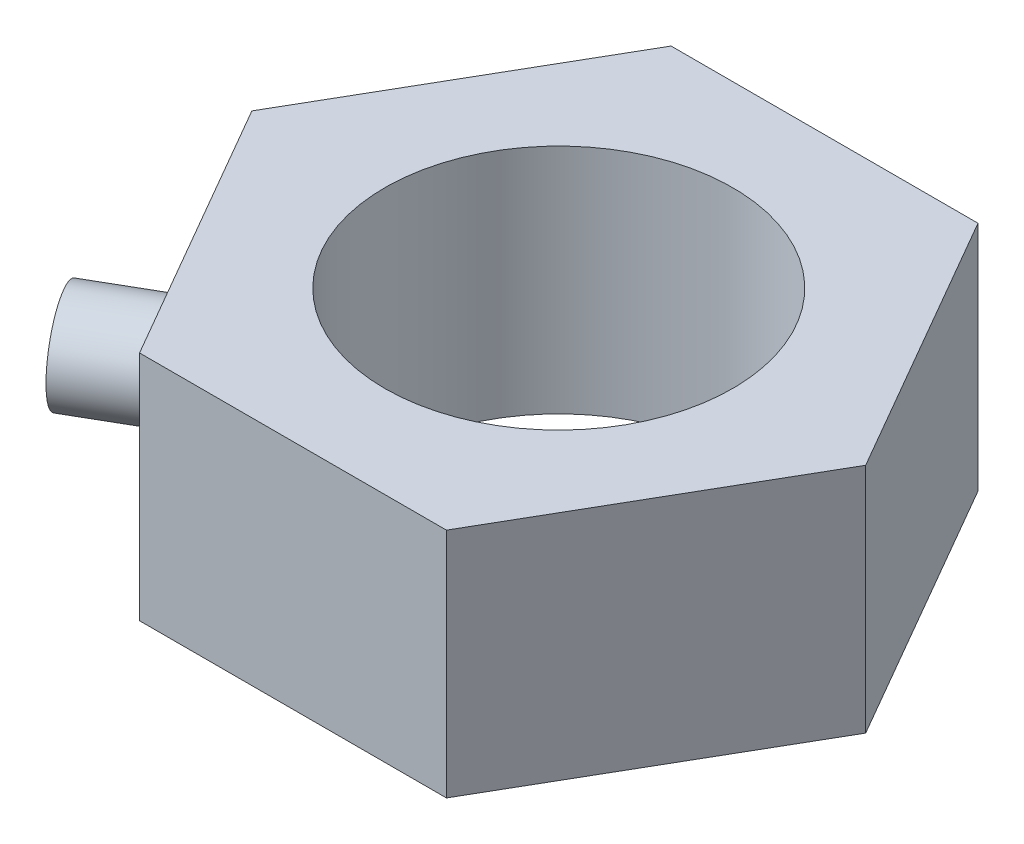
ISO-10303-21;
HEADER;
FILE_DESCRIPTION(('STEP AP214'),'2;1');
FILE_NAME('part.step','',(''),(''),'','','');
FILE_SCHEMA(('AUTOMOTIVE_DESIGN { 1 0 10303 214 1 1 1 1 }'));
ENDSEC;
DATA;
#1=APPLICATION_CONTEXT('core data for automotive mechanical design processes');
#2=APPLICATION_PROTOCOL_DEFINITION('international standard','automotive_design',2000,#1);
#3=PRODUCT_CONTEXT('',#1,'mechanical');
#4=PRODUCT('Part','Part','',(#3));
#5=PRODUCT_RELATED_PRODUCT_CATEGORY('part','',(#4));
#6=PRODUCT_DEFINITION_FORMATION('','',#4);
#7=PRODUCT_DEFINITION_CONTEXT('part definition',#1,'design');
#8=PRODUCT_DEFINITION('design','',#6,#7);
#9=PRODUCT_DEFINITION_SHAPE('','',#8);
#10=(LENGTH_UNIT() NAMED_UNIT(*) SI_UNIT(.MILLI.,.METRE.));
#11=(NAMED_UNIT(*) PLANE_ANGLE_UNIT() SI_UNIT($,.RADIAN.));
#12=(NAMED_UNIT(*) SI_UNIT($,.STERADIAN.) SOLID_ANGLE_UNIT());
#13=UNCERTAINTY_MEASURE_WITH_UNIT(LENGTH_MEASURE(1.E-05),#10,'distance_accuracy_value','');
#14=(GEOMETRIC_REPRESENTATION_CONTEXT(3) GLOBAL_UNCERTAINTY_ASSIGNED_CONTEXT((#13)) GLOBAL_UNIT_ASSIGNED_CONTEXT((#10,
#11,#12)) REPRESENTATION_CONTEXT('',''));
#15=CARTESIAN_POINT('',(0.,0.,0.));
#16=DIRECTION('',(0.,0.,1.));
#17=DIRECTION('',(1.,0.,0.));
#18=AXIS2_PLACEMENT_3D('',#15,#16,#17);
#19=CARTESIAN_POINT('',(3.17542648054295,1.2,0.));
#20=DIRECTION('',(-0.866025403784438,0.,0.500000000000001));
#21=DIRECTION('',(0.500000000000001,0.,0.866025403784438));
#22=AXIS2_PLACEMENT_3D('',#19,#20,#21);
#23=PLANE('',#22);
#24=DIRECTION('',(-0.500000000000001,0.,-0.866025403784438));
#25=VECTOR('',#24,1.);
#26=CARTESIAN_POINT('',(3.17542648054295,-1.2,0.));
#27=LINE('',#26,#25);
#28=CARTESIAN_POINT('',(3.17542648054295,-1.2,0.));
#29=VERTEX_POINT('',#28);
#30=CARTESIAN_POINT('',(1.58771324027147,-1.2,-2.75000000000001));
#31=VERTEX_POINT('',#30);
#32=EDGE_CURVE('E118',#29,#31,#27,.T.);
#33=ORIENTED_EDGE('',*,*,#32,.T.);
#34=DIRECTION('',(0.,-1.,0.));
#35=VECTOR('',#34,1.);
#36=CARTESIAN_POINT('',(1.58771324027147,1.2,-2.75000000000001));
#37=LINE('',#36,#35);
#38=CARTESIAN_POINT('',(1.58771324027147,1.2,-2.75000000000001));
#39=VERTEX_POINT('',#38);
#40=EDGE_CURVE('E41',#39,#31,#37,.T.);
#41=ORIENTED_EDGE('',*,*,#40,.F.);
#42=DIRECTION('',(-0.500000000000001,0.,-0.866025403784438));
#43=VECTOR('',#42,1.);
#44=CARTESIAN_POINT('',(3.17542648054295,1.2,0.));
#45=LINE('',#44,#43);
#46=CARTESIAN_POINT('',(3.17542648054295,1.2,0.));
#47=VERTEX_POINT('',#46);
#48=EDGE_CURVE('E129',#47,#39,#45,.T.);
#49=ORIENTED_EDGE('',*,*,#48,.F.);
#50=DIRECTION('',(0.,-1.,0.));
#51=VECTOR('',#50,1.);
#52=CARTESIAN_POINT('',(3.17542648054295,1.2,0.));
#53=LINE('',#52,#51);
#54=EDGE_CURVE('E114',#47,#29,#53,.T.);
#55=ORIENTED_EDGE('',*,*,#54,.T.);
#56=EDGE_LOOP('',(#33,#41,#49,#55));
#57=FACE_BOUND('',#56,.T.);
#58=ADVANCED_FACE('F33',(#57),#23,.F.);
#59=CARTESIAN_POINT('',(1.58771324027147,1.2,-2.75000000000001));
#60=DIRECTION('',(0.,0.,1.));
#61=DIRECTION('',(1.,0.,0.));
#62=AXIS2_PLACEMENT_3D('',#59,#60,#61);
#63=PLANE('',#62);
#64=DIRECTION('',(-1.,0.,0.));
#65=VECTOR('',#64,1.);
#66=CARTESIAN_POINT('',(1.58771324027147,-1.2,-2.75000000000001));
#67=LINE('',#66,#65);
#68=CARTESIAN_POINT('',(-1.58771324027149,-1.2,-2.75));
#69=VERTEX_POINT('',#68);
#70=EDGE_CURVE('E121',#31,#69,#67,.T.);
#71=ORIENTED_EDGE('',*,*,#70,.T.);
#72=DIRECTION('',(0.,-1.,0.));
#73=VECTOR('',#72,1.);
#74=CARTESIAN_POINT('',(-1.58771324027149,1.2,-2.75));
#75=LINE('',#74,#73);
#76=CARTESIAN_POINT('',(-1.58771324027149,1.2,-2.75));
#77=VERTEX_POINT('',#76);
#78=EDGE_CURVE('E133',#77,#69,#75,.T.);
#79=ORIENTED_EDGE('',*,*,#78,.F.);
#80=DIRECTION('',(-1.,0.,0.));
#81=VECTOR('',#80,1.);
#82=CARTESIAN_POINT('',(1.58771324027147,1.2,-2.75000000000001));
#83=LINE('',#82,#81);
#84=EDGE_CURVE('E87',#39,#77,#83,.T.);
#85=ORIENTED_EDGE('',*,*,#84,.F.);
#86=ORIENTED_EDGE('',*,*,#40,.T.);
#87=EDGE_LOOP('',(#71,#79,#85,#86));
#88=FACE_BOUND('',#87,.T.);
#89=ADVANCED_FACE('F151',(#88),#63,.F.);
#90=CARTESIAN_POINT('',(-1.58771324027149,1.2,-2.75));
#91=DIRECTION('',(0.866025403784441,0.,0.499999999999995));
#92=DIRECTION('',(0.499999999999995,0.,-0.866025403784442));
#93=AXIS2_PLACEMENT_3D('',#90,#91,#92);
#94=PLANE('',#93);
#95=DIRECTION('',(-0.499999999999995,0.,0.866025403784442));
#96=VECTOR('',#95,1.);
#97=CARTESIAN_POINT('',(-1.58771324027149,-1.2,-2.75));
#98=LINE('',#97,#96);
#99=CARTESIAN_POINT('',(-3.17542648054295,-1.2,0.));
#100=VERTEX_POINT('',#99);
#101=EDGE_CURVE('E124',#69,#100,#98,.T.);
#102=ORIENTED_EDGE('',*,*,#101,.T.);
#103=DIRECTION('',(0.,-1.,0.));
#104=VECTOR('',#103,1.);
#105=CARTESIAN_POINT('',(-3.17542648054295,1.2,0.));
#106=LINE('',#105,#104);
#107=CARTESIAN_POINT('',(-3.17542648054295,1.2,0.));
#108=VERTEX_POINT('',#107);
#109=EDGE_CURVE('E109',#108,#100,#106,.T.);
#110=ORIENTED_EDGE('',*,*,#109,.F.);
#111=DIRECTION('',(-0.499999999999995,0.,0.866025403784442));
#112=VECTOR('',#111,1.);
#113=CARTESIAN_POINT('',(-1.58771324027149,1.2,-2.75));
#114=LINE('',#113,#112);
#115=EDGE_CURVE('E100',#77,#108,#114,.T.);
#116=ORIENTED_EDGE('',*,*,#115,.F.);
#117=ORIENTED_EDGE('',*,*,#78,.T.);
#118=EDGE_LOOP('',(#102,#110,#116,#117));
#119=FACE_BOUND('',#118,.T.);
#120=ADVANCED_FACE('F154',(#119),#94,.F.);
#121=CARTESIAN_POINT('',(-3.17542648054295,1.2,0.));
#122=DIRECTION('',(0.866025403784434,0.,-0.500000000000007));
#123=DIRECTION('',(-0.500000000000007,0.,-0.866025403784435));
#124=AXIS2_PLACEMENT_3D('',#121,#122,#123);
#125=PLANE('',#124);
#126=CARTESIAN_POINT('',(-2.3815698604072,0.,1.37500000000002));
#127=DIRECTION('',(0.866025403784434,0.,-0.500000000000007));
#128=DIRECTION('',(-0.500000000000007,0.,-0.866025403784435));
#129=AXIS2_PLACEMENT_3D('',#126,#127,#128);
#130=CIRCLE('',#129,0.5);
#131=CARTESIAN_POINT('',(-2.6315698604072,0.,0.941987298107804));
#132=VERTEX_POINT('',#131);
#133=EDGE_CURVE('E11',#132,#132,#130,.F.);
#134=ORIENTED_EDGE('',*,*,#133,.F.);
#135=EDGE_LOOP('',(#134));
#136=FACE_BOUND('',#135,.T.);
#137=DIRECTION('',(0.500000000000007,0.,0.866025403784435));
#138=VECTOR('',#137,1.);
#139=CARTESIAN_POINT('',(-3.17542648054295,-1.2,0.));
#140=LINE('',#139,#138);
#141=CARTESIAN_POINT('',(-1.58771324027145,-1.2,2.75000000000002));
#142=VERTEX_POINT('',#141);
#143=EDGE_CURVE('E108',#100,#142,#140,.T.);
#144=ORIENTED_EDGE('',*,*,#143,.T.);
#145=DIRECTION('',(0.,-1.,0.));
#146=VECTOR('',#145,1.);
#147=CARTESIAN_POINT('',(-1.58771324027145,1.2,2.75000000000002));
#148=LINE('',#147,#146);
#149=CARTESIAN_POINT('',(-1.58771324027145,1.2,2.75000000000002));
#150=VERTEX_POINT('',#149);
#151=EDGE_CURVE('E105',#150,#142,#148,.T.);
#152=ORIENTED_EDGE('',*,*,#151,.F.);
#153=DIRECTION('',(0.500000000000007,0.,0.866025403784435));
#154=VECTOR('',#153,1.);
#155=CARTESIAN_POINT('',(-3.17542648054295,1.2,0.));
#156=LINE('',#155,#154);
#157=EDGE_CURVE('E94',#108,#150,#156,.T.);
#158=ORIENTED_EDGE('',*,*,#157,.F.);
#159=ORIENTED_EDGE('',*,*,#109,.T.);
#160=EDGE_LOOP('',(#144,#152,#158,#159));
#161=FACE_BOUND('',#160,.T.);
#162=ADVANCED_FACE('F106',(#136,#161),#125,.F.);
#163=CARTESIAN_POINT('',(-1.58771324027145,1.2,2.75000000000002));
#164=DIRECTION('',(0.,0.,-1.));
#165=DIRECTION('',(-1.,0.,0.));
#166=AXIS2_PLACEMENT_3D('',#163,#164,#165);
#167=PLANE('',#166);
#168=DIRECTION('',(1.,0.,0.));
#169=VECTOR('',#168,1.);
#170=CARTESIAN_POINT('',(-1.58771324027145,-1.2,2.75000000000002));
#171=LINE('',#170,#169);
#172=CARTESIAN_POINT('',(1.58771324027151,-1.2,2.74999999999999));
#173=VERTEX_POINT('',#172);
#174=EDGE_CURVE('E72',#142,#173,#171,.T.);
#175=ORIENTED_EDGE('',*,*,#174,.T.);
#176=DIRECTION('',(0.,-1.,0.));
#177=VECTOR('',#176,1.);
#178=CARTESIAN_POINT('',(1.58771324027151,1.2,2.74999999999999));
#179=LINE('',#178,#177);
#180=CARTESIAN_POINT('',(1.58771324027151,1.2,2.74999999999999));
#181=VERTEX_POINT('',#180);
#182=EDGE_CURVE('E110',#181,#173,#179,.T.);
#183=ORIENTED_EDGE('',*,*,#182,.F.);
#184=DIRECTION('',(1.,0.,0.));
#185=VECTOR('',#184,1.);
#186=CARTESIAN_POINT('',(-1.58771324027145,1.2,2.75000000000002));
#187=LINE('',#186,#185);
#188=EDGE_CURVE('E98',#150,#181,#187,.T.);
#189=ORIENTED_EDGE('',*,*,#188,.F.);
#190=ORIENTED_EDGE('',*,*,#151,.T.);
#191=EDGE_LOOP('',(#175,#183,#189,#190));
#192=FACE_BOUND('',#191,.T.);
#193=ADVANCED_FACE('F112',(#192),#167,.F.);
#194=CARTESIAN_POINT('',(1.58771324027151,1.2,2.74999999999999));
#195=DIRECTION('',(-0.866025403784441,0.,-0.499999999999995));
#196=DIRECTION('',(-0.499999999999995,0.,0.866025403784442));
#197=AXIS2_PLACEMENT_3D('',#194,#195,#196);
#198=PLANE('',#197);
#199=DIRECTION('',(0.499999999999995,0.,-0.866025403784442));
#200=VECTOR('',#199,1.);
#201=CARTESIAN_POINT('',(1.58771324027151,-1.2,2.74999999999999));
#202=LINE('',#201,#200);
#203=EDGE_CURVE('E78',#173,#29,#202,.T.);
#204=ORIENTED_EDGE('',*,*,#203,.T.);
#205=ORIENTED_EDGE('',*,*,#54,.F.);
#206=DIRECTION('',(0.499999999999995,0.,-0.866025403784442));
#207=VECTOR('',#206,1.);
#208=CARTESIAN_POINT('',(1.58771324027151,1.2,2.74999999999999));
#209=LINE('',#208,#207);
#210=EDGE_CURVE('E49',#181,#47,#209,.T.);
#211=ORIENTED_EDGE('',*,*,#210,.F.);
#212=ORIENTED_EDGE('',*,*,#182,.T.);
#213=EDGE_LOOP('',(#204,#205,#211,#212));
#214=FACE_BOUND('',#213,.T.);
#215=ADVANCED_FACE('F159',(#214),#198,.F.);
#216=CARTESIAN_POINT('',(0.,1.2,0.));
#217=DIRECTION('',(0.,1.,0.));
#218=DIRECTION('',(0.,0.,1.));
#219=AXIS2_PLACEMENT_3D('',#216,#217,#218);
#220=PLANE('',#219);
#221=CARTESIAN_POINT('',(0.,1.2,0.));
#222=DIRECTION('',(0.,1.,0.));
#223=DIRECTION('',(0.,0.,1.));
#224=AXIS2_PLACEMENT_3D('',#221,#222,#223);
#225=CIRCLE('',#224,1.8);
#226=CARTESIAN_POINT('',(0.,1.2,1.8));
#227=VERTEX_POINT('',#226);
#228=EDGE_CURVE('E122',#227,#227,#225,.T.);
#229=ORIENTED_EDGE('',*,*,#228,.F.);
#230=EDGE_LOOP('',(#229));
#231=FACE_BOUND('',#230,.T.);
#232=ORIENTED_EDGE('',*,*,#48,.T.);
#233=ORIENTED_EDGE('',*,*,#84,.T.);
#234=ORIENTED_EDGE('',*,*,#115,.T.);
#235=ORIENTED_EDGE('',*,*,#157,.T.);
#236=ORIENTED_EDGE('',*,*,#188,.T.);
#237=ORIENTED_EDGE('',*,*,#210,.T.);
#238=EDGE_LOOP('',(#232,#233,#234,#235,#236,#237));
#239=FACE_BOUND('',#238,.T.);
#240=ADVANCED_FACE('F96',(#231,#239),#220,.T.);
#241=CARTESIAN_POINT('',(0.,-1.2,0.));
#242=DIRECTION('',(0.,1.,0.));
#243=DIRECTION('',(0.,0.,1.));
#244=AXIS2_PLACEMENT_3D('',#241,#242,#243);
#245=PLANE('',#244);
#246=CARTESIAN_POINT('',(0.,-1.2,0.));
#247=DIRECTION('',(0.,1.,0.));
#248=DIRECTION('',(0.,0.,1.));
#249=AXIS2_PLACEMENT_3D('',#246,#247,#248);
#250=CIRCLE('',#249,1.8);
#251=CARTESIAN_POINT('',(0.,-1.2,1.8));
#252=VERTEX_POINT('',#251);
#253=EDGE_CURVE('E136',#252,#252,#250,.T.);
#254=ORIENTED_EDGE('',*,*,#253,.T.);
#255=EDGE_LOOP('',(#254));
#256=FACE_BOUND('',#255,.T.);
#257=ORIENTED_EDGE('',*,*,#32,.F.);
#258=ORIENTED_EDGE('',*,*,#203,.F.);
#259=ORIENTED_EDGE('',*,*,#174,.F.);
#260=ORIENTED_EDGE('',*,*,#143,.F.);
#261=ORIENTED_EDGE('',*,*,#101,.F.);
#262=ORIENTED_EDGE('',*,*,#70,.F.);
#263=EDGE_LOOP('',(#257,#258,#259,#260,#261,#262));
#264=FACE_BOUND('',#263,.T.);
#265=ADVANCED_FACE('F157',(#256,#264),#245,.F.);
#266=CARTESIAN_POINT('',(0.,-48.8,0.));
#267=DIRECTION('',(0.,1.,0.));
#268=DIRECTION('',(0.,0.,1.));
#269=AXIS2_PLACEMENT_3D('',#266,#267,#268);
#270=CYLINDRICAL_SURFACE('',#269,1.8);
#271=ORIENTED_EDGE('',*,*,#228,.T.);
#272=EDGE_LOOP('',(#271));
#273=FACE_BOUND('',#272,.T.);
#274=ORIENTED_EDGE('',*,*,#253,.F.);
#275=EDGE_LOOP('',(#274));
#276=FACE_BOUND('',#275,.T.);
#277=ADVANCED_FACE('F188',(#273,#276),#270,.F.);
#278=CARTESIAN_POINT('',(-3.24759526419163,0.,1.87500000000003));
#279=DIRECTION('',(0.866025403784435,0.,-0.500000000000007));
#280=DIRECTION('',(-0.500000000000007,0.,-0.866025403784434));
#281=AXIS2_PLACEMENT_3D('',#278,#279,#280);
#282=CYLINDRICAL_SURFACE('',#281,0.5);
#283=CARTESIAN_POINT('',(-3.24759526419163,0.,1.87500000000003));
#284=DIRECTION('',(-0.866025403784435,0.,0.500000000000007));
#285=DIRECTION('',(0.500000000000007,0.,0.866025403784435));
#286=AXIS2_PLACEMENT_3D('',#283,#284,#285);
#287=CIRCLE('',#286,0.5);
#288=CARTESIAN_POINT('',(-2.99759526419163,0.,2.30801270189225));
#289=VERTEX_POINT('',#288);
#290=EDGE_CURVE('E138',#289,#289,#287,.T.);
#291=ORIENTED_EDGE('',*,*,#290,.F.);
#292=EDGE_LOOP('',(#291));
#293=FACE_BOUND('',#292,.T.);
#294=ORIENTED_EDGE('',*,*,#133,.T.);
#295=EDGE_LOOP('',(#294));
#296=FACE_BOUND('',#295,.T.);
#297=ADVANCED_FACE('F185',(#293,#296),#282,.T.);
#298=CARTESIAN_POINT('',(-3.24759526419163,0.,1.87500000000003));
#299=DIRECTION('',(-0.866025403784435,0.,0.500000000000007));
#300=DIRECTION('',(0.500000000000007,0.,0.866025403784435));
#301=AXIS2_PLACEMENT_3D('',#298,#299,#300);
#302=PLANE('',#301);
#303=ORIENTED_EDGE('',*,*,#290,.T.);
#304=EDGE_LOOP('',(#303));
#305=FACE_BOUND('',#304,.T.);
#306=ADVANCED_FACE('F187',(#305),#302,.T.);
#307=CLOSED_SHELL('',(#58,#89,#120,#162,#193,#215,#240,#265,#277,#297,#306));
#308=MANIFOLD_SOLID_BREP('B2',#307);
#309=ADVANCED_BREP_SHAPE_REPRESENTATION('',(#18,#308),#14);
#310=SHAPE_DEFINITION_REPRESENTATION(#9,#309);
ENDSEC;
END-ISO-10303-21;
